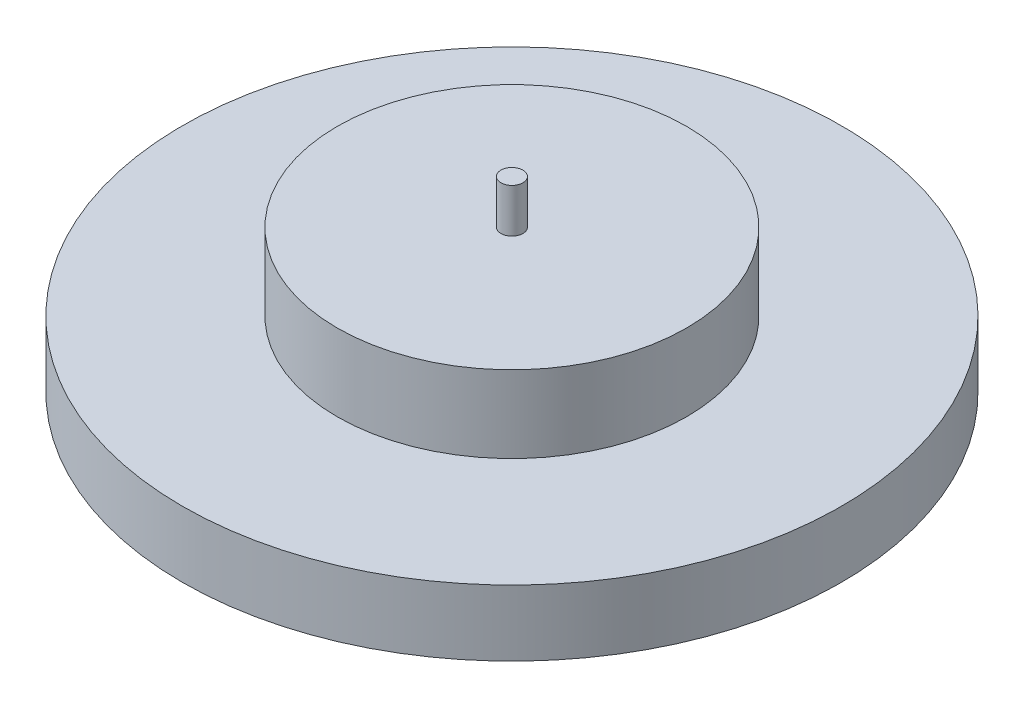
ISO-10303-21;
HEADER;
FILE_DESCRIPTION(('STEP AP214'),'2;1');
FILE_NAME('part.step','',(''),(''),'','','');
FILE_SCHEMA(('AUTOMOTIVE_DESIGN { 1 0 10303 214 1 1 1 1 }'));
ENDSEC;
DATA;
#1=APPLICATION_CONTEXT('core data for automotive mechanical design processes');
#2=APPLICATION_PROTOCOL_DEFINITION('international standard','automotive_design',2000,#1);
#3=PRODUCT_CONTEXT('',#1,'mechanical');
#4=PRODUCT('Part','Part','',(#3));
#5=PRODUCT_RELATED_PRODUCT_CATEGORY('part','',(#4));
#6=PRODUCT_DEFINITION_FORMATION('','',#4);
#7=PRODUCT_DEFINITION_CONTEXT('part definition',#1,'design');
#8=PRODUCT_DEFINITION('design','',#6,#7);
#9=PRODUCT_DEFINITION_SHAPE('','',#8);
#10=(LENGTH_UNIT() NAMED_UNIT(*) SI_UNIT(.MILLI.,.METRE.));
#11=(NAMED_UNIT(*) PLANE_ANGLE_UNIT() SI_UNIT($,.RADIAN.));
#12=(NAMED_UNIT(*) SI_UNIT($,.STERADIAN.) SOLID_ANGLE_UNIT());
#13=UNCERTAINTY_MEASURE_WITH_UNIT(LENGTH_MEASURE(1.E-05),#10,'distance_accuracy_value','');
#14=(GEOMETRIC_REPRESENTATION_CONTEXT(3) GLOBAL_UNCERTAINTY_ASSIGNED_CONTEXT((#13)) GLOBAL_UNIT_ASSIGNED_CONTEXT((#10,
#11,#12)) REPRESENTATION_CONTEXT('',''));
#15=CARTESIAN_POINT('',(0.,0.,0.));
#16=DIRECTION('',(0.,0.,1.));
#17=DIRECTION('',(1.,0.,0.));
#18=AXIS2_PLACEMENT_3D('',#15,#16,#17);
#19=CARTESIAN_POINT('',(0.,3.,0.));
#20=DIRECTION('',(0.,-1.,0.));
#21=DIRECTION('',(0.,0.,-1.));
#22=AXIS2_PLACEMENT_3D('',#19,#20,#21);
#23=CYLINDRICAL_SURFACE('',#22,15.);
#24=CARTESIAN_POINT('',(0.,3.,0.));
#25=DIRECTION('',(0.,1.,0.));
#26=DIRECTION('',(0.,0.,1.));
#27=AXIS2_PLACEMENT_3D('',#24,#25,#26);
#28=CIRCLE('',#27,15.);
#29=CARTESIAN_POINT('',(0.,3.,15.));
#30=VERTEX_POINT('',#29);
#31=EDGE_CURVE('E46',#30,#30,#28,.T.);
#32=ORIENTED_EDGE('',*,*,#31,.F.);
#33=EDGE_LOOP('',(#32));
#34=FACE_BOUND('',#33,.T.);
#35=CARTESIAN_POINT('',(0.,0.,0.));
#36=DIRECTION('',(0.,1.,0.));
#37=DIRECTION('',(0.,0.,1.));
#38=AXIS2_PLACEMENT_3D('',#35,#36,#37);
#39=CIRCLE('',#38,15.);
#40=CARTESIAN_POINT('',(0.,0.,15.));
#41=VERTEX_POINT('',#40);
#42=EDGE_CURVE('E42',#41,#41,#39,.T.);
#43=ORIENTED_EDGE('',*,*,#42,.T.);
#44=EDGE_LOOP('',(#43));
#45=FACE_BOUND('',#44,.T.);
#46=ADVANCED_FACE('F39',(#34,#45),#23,.T.);
#47=CARTESIAN_POINT('',(0.,3.,0.));
#48=DIRECTION('',(0.,1.,0.));
#49=DIRECTION('',(0.,0.,1.));
#50=AXIS2_PLACEMENT_3D('',#47,#48,#49);
#51=PLANE('',#50);
#52=CARTESIAN_POINT('',(0.,3.,0.));
#53=DIRECTION('',(0.,1.,0.));
#54=DIRECTION('',(0.,0.,1.));
#55=AXIS2_PLACEMENT_3D('',#52,#53,#54);
#56=CIRCLE('',#55,7.95);
#57=CARTESIAN_POINT('',(0.,3.,7.95));
#58=VERTEX_POINT('',#57);
#59=EDGE_CURVE('E10',#58,#58,#56,.T.);
#60=ORIENTED_EDGE('',*,*,#59,.F.);
#61=EDGE_LOOP('',(#60));
#62=FACE_BOUND('',#61,.T.);
#63=ORIENTED_EDGE('',*,*,#31,.T.);
#64=EDGE_LOOP('',(#63));
#65=FACE_BOUND('',#64,.T.);
#66=ADVANCED_FACE('F84',(#62,#65),#51,.T.);
#67=CARTESIAN_POINT('',(0.,0.,0.));
#68=DIRECTION('',(0.,1.,0.));
#69=DIRECTION('',(0.,0.,1.));
#70=AXIS2_PLACEMENT_3D('',#67,#68,#69);
#71=PLANE('',#70);
#72=ORIENTED_EDGE('',*,*,#42,.F.);
#73=EDGE_LOOP('',(#72));
#74=FACE_BOUND('',#73,.T.);
#75=ADVANCED_FACE('F78',(#74),#71,.F.);
#76=CARTESIAN_POINT('',(0.,6.5,0.));
#77=DIRECTION('',(0.,-1.,0.));
#78=DIRECTION('',(0.,0.,-1.));
#79=AXIS2_PLACEMENT_3D('',#76,#77,#78);
#80=CYLINDRICAL_SURFACE('',#79,7.95);
#81=CARTESIAN_POINT('',(0.,6.5,0.));
#82=DIRECTION('',(0.,1.,0.));
#83=DIRECTION('',(0.,0.,1.));
#84=AXIS2_PLACEMENT_3D('',#81,#82,#83);
#85=CIRCLE('',#84,7.95);
#86=CARTESIAN_POINT('',(0.,6.5,7.95));
#87=VERTEX_POINT('',#86);
#88=EDGE_CURVE('E52',#87,#87,#85,.T.);
#89=ORIENTED_EDGE('',*,*,#88,.F.);
#90=EDGE_LOOP('',(#89));
#91=FACE_BOUND('',#90,.T.);
#92=ORIENTED_EDGE('',*,*,#59,.T.);
#93=EDGE_LOOP('',(#92));
#94=FACE_BOUND('',#93,.T.);
#95=ADVANCED_FACE('F73',(#91,#94),#80,.T.);
#96=CARTESIAN_POINT('',(0.,6.5,0.));
#97=DIRECTION('',(0.,1.,0.));
#98=DIRECTION('',(0.,0.,1.));
#99=AXIS2_PLACEMENT_3D('',#96,#97,#98);
#100=PLANE('',#99);
#101=CARTESIAN_POINT('',(0.,6.5,0.));
#102=DIRECTION('',(0.,1.,0.));
#103=DIRECTION('',(0.,0.,1.));
#104=AXIS2_PLACEMENT_3D('',#101,#102,#103);
#105=CIRCLE('',#104,0.5);
#106=CARTESIAN_POINT('',(0.,6.5,0.5));
#107=VERTEX_POINT('',#106);
#108=EDGE_CURVE('E56',#107,#107,#105,.T.);
#109=ORIENTED_EDGE('',*,*,#108,.F.);
#110=EDGE_LOOP('',(#109));
#111=FACE_BOUND('',#110,.T.);
#112=ORIENTED_EDGE('',*,*,#88,.T.);
#113=EDGE_LOOP('',(#112));
#114=FACE_BOUND('',#113,.T.);
#115=ADVANCED_FACE('F67',(#111,#114),#100,.T.);
#116=CARTESIAN_POINT('',(0.,8.5,0.));
#117=DIRECTION('',(0.,-1.,0.));
#118=DIRECTION('',(0.,0.,-1.));
#119=AXIS2_PLACEMENT_3D('',#116,#117,#118);
#120=CYLINDRICAL_SURFACE('',#119,0.5);
#121=CARTESIAN_POINT('',(0.,8.5,0.));
#122=DIRECTION('',(0.,1.,0.));
#123=DIRECTION('',(0.,0.,1.));
#124=AXIS2_PLACEMENT_3D('',#121,#122,#123);
#125=CIRCLE('',#124,0.5);
#126=CARTESIAN_POINT('',(0.,8.5,0.5));
#127=VERTEX_POINT('',#126);
#128=EDGE_CURVE('E55',#127,#127,#125,.T.);
#129=ORIENTED_EDGE('',*,*,#128,.F.);
#130=EDGE_LOOP('',(#129));
#131=FACE_BOUND('',#130,.T.);
#132=ORIENTED_EDGE('',*,*,#108,.T.);
#133=EDGE_LOOP('',(#132));
#134=FACE_BOUND('',#133,.T.);
#135=ADVANCED_FACE('F64',(#131,#134),#120,.T.);
#136=CARTESIAN_POINT('',(0.,8.5,0.));
#137=DIRECTION('',(0.,1.,0.));
#138=DIRECTION('',(0.,0.,1.));
#139=AXIS2_PLACEMENT_3D('',#136,#137,#138);
#140=PLANE('',#139);
#141=ORIENTED_EDGE('',*,*,#128,.T.);
#142=EDGE_LOOP('',(#141));
#143=FACE_BOUND('',#142,.T.);
#144=ADVANCED_FACE('F62',(#143),#140,.T.);
#145=CLOSED_SHELL('',(#46,#66,#75,#95,#115,#135,#144));
#146=MANIFOLD_SOLID_BREP('B2',#145);
#147=ADVANCED_BREP_SHAPE_REPRESENTATION('',(#18,#146),#14);
#148=SHAPE_DEFINITION_REPRESENTATION(#9,#147);
ENDSEC;
END-ISO-10303-21;
